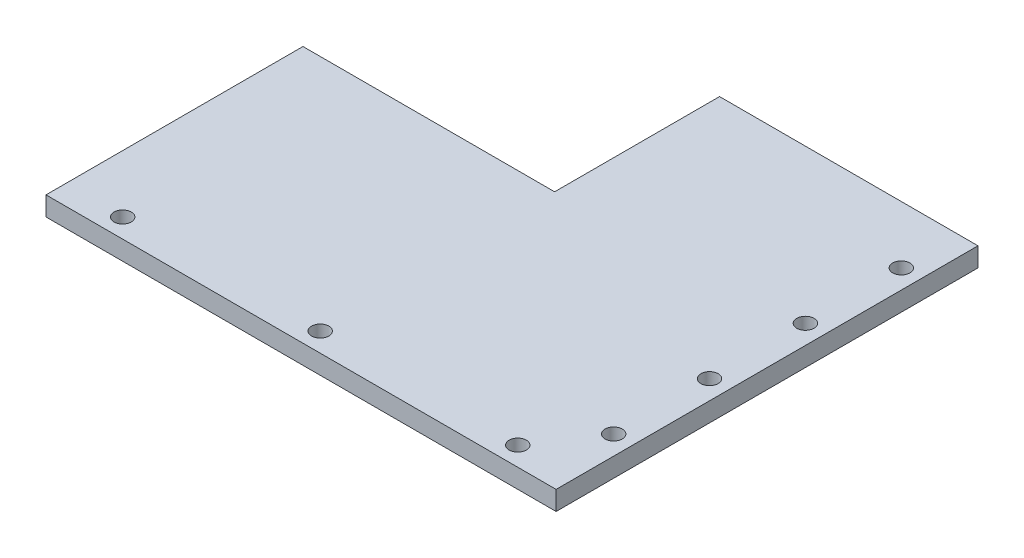
ISO-10303-21;
HEADER;
FILE_DESCRIPTION(('STEP AP214'),'2;1');
FILE_NAME('part.step','',(''),(''),'','','');
FILE_SCHEMA(('AUTOMOTIVE_DESIGN { 1 0 10303 214 1 1 1 1 }'));
ENDSEC;
DATA;
#1=APPLICATION_CONTEXT('core data for automotive mechanical design processes');
#2=APPLICATION_PROTOCOL_DEFINITION('international standard','automotive_design',2000,#1);
#3=PRODUCT_CONTEXT('',#1,'mechanical');
#4=PRODUCT('Part','Part','',(#3));
#5=PRODUCT_RELATED_PRODUCT_CATEGORY('part','',(#4));
#6=PRODUCT_DEFINITION_FORMATION('','',#4);
#7=PRODUCT_DEFINITION_CONTEXT('part definition',#1,'design');
#8=PRODUCT_DEFINITION('design','',#6,#7);
#9=PRODUCT_DEFINITION_SHAPE('','',#8);
#10=(LENGTH_UNIT() NAMED_UNIT(*) SI_UNIT(.MILLI.,.METRE.));
#11=(NAMED_UNIT(*) PLANE_ANGLE_UNIT() SI_UNIT($,.RADIAN.));
#12=(NAMED_UNIT(*) SI_UNIT($,.STERADIAN.) SOLID_ANGLE_UNIT());
#13=UNCERTAINTY_MEASURE_WITH_UNIT(LENGTH_MEASURE(1.E-05),#10,'distance_accuracy_value','');
#14=(GEOMETRIC_REPRESENTATION_CONTEXT(3) GLOBAL_UNCERTAINTY_ASSIGNED_CONTEXT((#13)) GLOBAL_UNIT_ASSIGNED_CONTEXT((#10,
#11,#12)) REPRESENTATION_CONTEXT('',''));
#15=CARTESIAN_POINT('',(0.,0.,0.));
#16=DIRECTION('',(0.,0.,1.));
#17=DIRECTION('',(1.,0.,0.));
#18=AXIS2_PLACEMENT_3D('',#15,#16,#17);
#19=CARTESIAN_POINT('',(0.,5.,0.));
#20=DIRECTION('',(0.,1.,0.));
#21=DIRECTION('',(0.,0.,1.));
#22=AXIS2_PLACEMENT_3D('',#19,#20,#21);
#23=PLANE('',#22);
#24=CARTESIAN_POINT('',(-50.6134210190672,5.,49.2667391887022));
#25=DIRECTION('',(0.,1.,0.));
#26=DIRECTION('',(0.,0.,1.));
#27=AXIS2_PLACEMENT_3D('',#24,#25,#26);
#28=CIRCLE('',#27,2.25);
#29=CARTESIAN_POINT('',(-50.6134210190672,5.,51.5167391887022));
#30=VERTEX_POINT('',#29);
#31=EDGE_CURVE('E224',#30,#30,#28,.T.);
#32=ORIENTED_EDGE('',*,*,#31,.F.);
#33=EDGE_LOOP('',(#32));
#34=FACE_BOUND('',#33,.T.);
#35=CARTESIAN_POINT('',(62.3865789809338,5.,34.2667391887022));
#36=DIRECTION('',(0.,1.,0.));
#37=DIRECTION('',(0.,0.,1.));
#38=AXIS2_PLACEMENT_3D('',#35,#36,#37);
#39=CIRCLE('',#38,2.25);
#40=CARTESIAN_POINT('',(62.3865789809338,5.,36.5167391887022));
#41=VERTEX_POINT('',#40);
#42=EDGE_CURVE('E240',#41,#41,#39,.T.);
#43=ORIENTED_EDGE('',*,*,#42,.F.);
#44=EDGE_LOOP('',(#43));
#45=FACE_BOUND('',#44,.T.);
#46=CARTESIAN_POINT('',(62.3865789809331,5.,-15.7332608112978));
#47=DIRECTION('',(0.,1.,0.));
#48=DIRECTION('',(0.,0.,1.));
#49=AXIS2_PLACEMENT_3D('',#46,#47,#48);
#50=CIRCLE('',#49,2.25);
#51=CARTESIAN_POINT('',(62.3865789809331,5.,-13.4832608112978));
#52=VERTEX_POINT('',#51);
#53=EDGE_CURVE('E256',#52,#52,#50,.T.);
#54=ORIENTED_EDGE('',*,*,#53,.F.);
#55=EDGE_LOOP('',(#54));
#56=FACE_BOUND('',#55,.T.);
#57=DIRECTION('',(0.,0.,-1.));
#58=VECTOR('',#57,1.);
#59=CARTESIAN_POINT('',(67.3865789809328,5.,-55.7332608112978));
#60=LINE('',#59,#58);
#61=CARTESIAN_POINT('',(67.3865789809328,5.,54.2667391887022));
#62=VERTEX_POINT('',#61);
#63=CARTESIAN_POINT('',(67.3865789809328,5.,-55.7332608112978));
#64=VERTEX_POINT('',#63);
#65=EDGE_CURVE('E146',#62,#64,#60,.T.);
#66=ORIENTED_EDGE('',*,*,#65,.T.);
#67=DIRECTION('',(-1.,0.,0.));
#68=VECTOR('',#67,1.);
#69=CARTESIAN_POINT('',(0.,5.,-55.7332608112978));
#70=LINE('',#69,#68);
#71=CARTESIAN_POINT('',(0.,5.,-55.7332608112978));
#72=VERTEX_POINT('',#71);
#73=EDGE_CURVE('E94',#64,#72,#70,.T.);
#74=ORIENTED_EDGE('',*,*,#73,.T.);
#75=DIRECTION('',(0.,0.,1.));
#76=VECTOR('',#75,1.);
#77=CARTESIAN_POINT('',(0.,5.,-55.7332608112978));
#78=LINE('',#77,#76);
#79=CARTESIAN_POINT('',(0.,5.,-12.7332608112978));
#80=VERTEX_POINT('',#79);
#81=EDGE_CURVE('E107',#72,#80,#78,.T.);
#82=ORIENTED_EDGE('',*,*,#81,.T.);
#83=DIRECTION('',(-1.,0.,0.));
#84=VECTOR('',#83,1.);
#85=CARTESIAN_POINT('',(0.,5.,-12.7332608112978));
#86=LINE('',#85,#84);
#87=CARTESIAN_POINT('',(-65.6134210190672,5.,-12.7332608112978));
#88=VERTEX_POINT('',#87);
#89=EDGE_CURVE('E101',#80,#88,#86,.T.);
#90=ORIENTED_EDGE('',*,*,#89,.T.);
#91=DIRECTION('',(0.,0.,1.));
#92=VECTOR('',#91,1.);
#93=CARTESIAN_POINT('',(-65.6134210190672,5.,-12.7332608112978));
#94=LINE('',#93,#92);
#95=CARTESIAN_POINT('',(-65.6134210190672,5.,54.2667391887022));
#96=VERTEX_POINT('',#95);
#97=EDGE_CURVE('E105',#88,#96,#94,.T.);
#98=ORIENTED_EDGE('',*,*,#97,.T.);
#99=DIRECTION('',(1.,0.,0.));
#100=VECTOR('',#99,1.);
#101=CARTESIAN_POINT('',(-65.6134210190672,5.,54.2667391887022));
#102=LINE('',#101,#100);
#103=EDGE_CURVE('E57',#96,#62,#102,.T.);
#104=ORIENTED_EDGE('',*,*,#103,.T.);
#105=EDGE_LOOP('',(#66,#74,#82,#90,#98,#104));
#106=FACE_BOUND('',#105,.T.);
#107=CARTESIAN_POINT('',(62.3865789809328,5.,-40.7332608112978));
#108=DIRECTION('',(0.,1.,0.));
#109=DIRECTION('',(0.,0.,1.));
#110=AXIS2_PLACEMENT_3D('',#107,#108,#109);
#111=CIRCLE('',#110,2.25);
#112=CARTESIAN_POINT('',(62.3865789809328,5.,-38.4832608112978));
#113=VERTEX_POINT('',#112);
#114=EDGE_CURVE('E134',#113,#113,#111,.T.);
#115=ORIENTED_EDGE('',*,*,#114,.F.);
#116=EDGE_LOOP('',(#115));
#117=FACE_BOUND('',#116,.T.);
#118=CARTESIAN_POINT('',(62.3865789809335,5.,9.26673918870222));
#119=DIRECTION('',(0.,1.,0.));
#120=DIRECTION('',(0.,0.,1.));
#121=AXIS2_PLACEMENT_3D('',#118,#119,#120);
#122=CIRCLE('',#121,2.25);
#123=CARTESIAN_POINT('',(62.3865789809335,5.,11.5167391887022));
#124=VERTEX_POINT('',#123);
#125=EDGE_CURVE('E248',#124,#124,#122,.T.);
#126=ORIENTED_EDGE('',*,*,#125,.F.);
#127=EDGE_LOOP('',(#126));
#128=FACE_BOUND('',#127,.T.);
#129=CARTESIAN_POINT('',(0.886578980932765,5.,49.2667391887022));
#130=DIRECTION('',(0.,1.,0.));
#131=DIRECTION('',(0.,0.,1.));
#132=AXIS2_PLACEMENT_3D('',#129,#130,#131);
#133=CIRCLE('',#132,2.25);
#134=CARTESIAN_POINT('',(0.886578980932765,5.,51.5167391887022));
#135=VERTEX_POINT('',#134);
#136=EDGE_CURVE('E232',#135,#135,#133,.T.);
#137=ORIENTED_EDGE('',*,*,#136,.F.);
#138=EDGE_LOOP('',(#137));
#139=FACE_BOUND('',#138,.T.);
#140=CARTESIAN_POINT('',(52.3865789809328,5.,49.2667391887022));
#141=DIRECTION('',(0.,1.,0.));
#142=DIRECTION('',(0.,0.,-1.));
#143=AXIS2_PLACEMENT_3D('',#140,#141,#142);
#144=CIRCLE('',#143,2.25);
#145=CARTESIAN_POINT('',(52.3865789809328,5.,47.0167391887022));
#146=VERTEX_POINT('',#145);
#147=EDGE_CURVE('E213',#146,#146,#144,.T.);
#148=ORIENTED_EDGE('',*,*,#147,.F.);
#149=EDGE_LOOP('',(#148));
#150=FACE_BOUND('',#149,.T.);
#151=ADVANCED_FACE('F39',(#34,#45,#56,#106,#117,#128,#139,#150),#23,.T.);
#152=CARTESIAN_POINT('',(0.,0.,0.));
#153=DIRECTION('',(0.,1.,0.));
#154=DIRECTION('',(0.,0.,1.));
#155=AXIS2_PLACEMENT_3D('',#152,#153,#154);
#156=PLANE('',#155);
#157=DIRECTION('',(0.,0.,-1.));
#158=VECTOR('',#157,1.);
#159=CARTESIAN_POINT('',(67.3865789809328,0.,-55.7332608112978));
#160=LINE('',#159,#158);
#161=CARTESIAN_POINT('',(67.3865789809328,0.,54.2667391887022));
#162=VERTEX_POINT('',#161);
#163=CARTESIAN_POINT('',(67.3865789809328,0.,-55.7332608112978));
#164=VERTEX_POINT('',#163);
#165=EDGE_CURVE('E129',#162,#164,#160,.T.);
#166=ORIENTED_EDGE('',*,*,#165,.F.);
#167=DIRECTION('',(1.,0.,0.));
#168=VECTOR('',#167,1.);
#169=CARTESIAN_POINT('',(-65.6134210190672,0.,54.2667391887022));
#170=LINE('',#169,#168);
#171=CARTESIAN_POINT('',(-65.6134210190672,0.,54.2667391887022));
#172=VERTEX_POINT('',#171);
#173=EDGE_CURVE('E86',#172,#162,#170,.T.);
#174=ORIENTED_EDGE('',*,*,#173,.F.);
#175=DIRECTION('',(0.,0.,1.));
#176=VECTOR('',#175,1.);
#177=CARTESIAN_POINT('',(-65.6134210190672,0.,-12.7332608112978));
#178=LINE('',#177,#176);
#179=CARTESIAN_POINT('',(-65.6134210190672,0.,-12.7332608112978));
#180=VERTEX_POINT('',#179);
#181=EDGE_CURVE('E80',#180,#172,#178,.T.);
#182=ORIENTED_EDGE('',*,*,#181,.F.);
#183=DIRECTION('',(-1.,0.,0.));
#184=VECTOR('',#183,1.);
#185=CARTESIAN_POINT('',(0.,0.,-12.7332608112978));
#186=LINE('',#185,#184);
#187=CARTESIAN_POINT('',(0.,0.,-12.7332608112978));
#188=VERTEX_POINT('',#187);
#189=EDGE_CURVE('E116',#188,#180,#186,.T.);
#190=ORIENTED_EDGE('',*,*,#189,.F.);
#191=DIRECTION('',(0.,0.,1.));
#192=VECTOR('',#191,1.);
#193=CARTESIAN_POINT('',(0.,0.,-55.7332608112978));
#194=LINE('',#193,#192);
#195=CARTESIAN_POINT('',(0.,0.,-55.7332608112978));
#196=VERTEX_POINT('',#195);
#197=EDGE_CURVE('E137',#196,#188,#194,.T.);
#198=ORIENTED_EDGE('',*,*,#197,.F.);
#199=DIRECTION('',(-1.,0.,0.));
#200=VECTOR('',#199,1.);
#201=CARTESIAN_POINT('',(0.,0.,-55.7332608112978));
#202=LINE('',#201,#200);
#203=EDGE_CURVE('E133',#164,#196,#202,.T.);
#204=ORIENTED_EDGE('',*,*,#203,.F.);
#205=EDGE_LOOP('',(#166,#174,#182,#190,#198,#204));
#206=FACE_BOUND('',#205,.T.);
#207=CARTESIAN_POINT('',(62.3865789809328,0.,-40.7332608112978));
#208=DIRECTION('',(0.,1.,0.));
#209=DIRECTION('',(0.,0.,1.));
#210=AXIS2_PLACEMENT_3D('',#207,#208,#209);
#211=CIRCLE('',#210,2.25);
#212=CARTESIAN_POINT('',(62.3865789809328,0.,-38.4832608112978));
#213=VERTEX_POINT('',#212);
#214=EDGE_CURVE('E260',#213,#213,#211,.T.);
#215=ORIENTED_EDGE('',*,*,#214,.T.);
#216=EDGE_LOOP('',(#215));
#217=FACE_BOUND('',#216,.T.);
#218=CARTESIAN_POINT('',(62.3865789809331,0.,-15.7332608112978));
#219=DIRECTION('',(0.,1.,0.));
#220=DIRECTION('',(0.,0.,1.));
#221=AXIS2_PLACEMENT_3D('',#218,#219,#220);
#222=CIRCLE('',#221,2.25);
#223=CARTESIAN_POINT('',(62.3865789809331,0.,-13.4832608112978));
#224=VERTEX_POINT('',#223);
#225=EDGE_CURVE('E252',#224,#224,#222,.T.);
#226=ORIENTED_EDGE('',*,*,#225,.T.);
#227=EDGE_LOOP('',(#226));
#228=FACE_BOUND('',#227,.T.);
#229=CARTESIAN_POINT('',(62.3865789809335,0.,9.26673918870222));
#230=DIRECTION('',(0.,1.,0.));
#231=DIRECTION('',(0.,0.,1.));
#232=AXIS2_PLACEMENT_3D('',#229,#230,#231);
#233=CIRCLE('',#232,2.25);
#234=CARTESIAN_POINT('',(62.3865789809335,0.,11.5167391887022));
#235=VERTEX_POINT('',#234);
#236=EDGE_CURVE('E244',#235,#235,#233,.T.);
#237=ORIENTED_EDGE('',*,*,#236,.T.);
#238=EDGE_LOOP('',(#237));
#239=FACE_BOUND('',#238,.T.);
#240=CARTESIAN_POINT('',(62.3865789809338,0.,34.2667391887022));
#241=DIRECTION('',(0.,1.,0.));
#242=DIRECTION('',(0.,0.,1.));
#243=AXIS2_PLACEMENT_3D('',#240,#241,#242);
#244=CIRCLE('',#243,2.25);
#245=CARTESIAN_POINT('',(62.3865789809338,0.,36.5167391887022));
#246=VERTEX_POINT('',#245);
#247=EDGE_CURVE('E236',#246,#246,#244,.T.);
#248=ORIENTED_EDGE('',*,*,#247,.T.);
#249=EDGE_LOOP('',(#248));
#250=FACE_BOUND('',#249,.T.);
#251=CARTESIAN_POINT('',(0.886578980932765,0.,49.2667391887022));
#252=DIRECTION('',(0.,1.,0.));
#253=DIRECTION('',(0.,0.,1.));
#254=AXIS2_PLACEMENT_3D('',#251,#252,#253);
#255=CIRCLE('',#254,2.25);
#256=CARTESIAN_POINT('',(0.886578980932765,0.,51.5167391887022));
#257=VERTEX_POINT('',#256);
#258=EDGE_CURVE('E228',#257,#257,#255,.T.);
#259=ORIENTED_EDGE('',*,*,#258,.T.);
#260=EDGE_LOOP('',(#259));
#261=FACE_BOUND('',#260,.T.);
#262=CARTESIAN_POINT('',(-50.6134210190672,0.,49.2667391887022));
#263=DIRECTION('',(0.,1.,0.));
#264=DIRECTION('',(0.,0.,1.));
#265=AXIS2_PLACEMENT_3D('',#262,#263,#264);
#266=CIRCLE('',#265,2.25);
#267=CARTESIAN_POINT('',(-50.6134210190672,0.,51.5167391887022));
#268=VERTEX_POINT('',#267);
#269=EDGE_CURVE('E221',#268,#268,#266,.T.);
#270=ORIENTED_EDGE('',*,*,#269,.T.);
#271=EDGE_LOOP('',(#270));
#272=FACE_BOUND('',#271,.T.);
#273=CARTESIAN_POINT('',(52.3865789809328,0.,49.2667391887022));
#274=DIRECTION('',(0.,1.,0.));
#275=DIRECTION('',(0.,0.,-1.));
#276=AXIS2_PLACEMENT_3D('',#273,#274,#275);
#277=CIRCLE('',#276,2.25);
#278=CARTESIAN_POINT('',(52.3865789809328,0.,47.0167391887022));
#279=VERTEX_POINT('',#278);
#280=EDGE_CURVE('E216',#279,#279,#277,.T.);
#281=ORIENTED_EDGE('',*,*,#280,.T.);
#282=EDGE_LOOP('',(#281));
#283=FACE_BOUND('',#282,.T.);
#284=ADVANCED_FACE('F159',(#206,#217,#228,#239,#250,#261,#272,#283),#156,.F.);
#285=CARTESIAN_POINT('',(67.3865789809328,5.,-55.7332608112978));
#286=DIRECTION('',(-1.,0.,0.));
#287=DIRECTION('',(0.,0.,1.));
#288=AXIS2_PLACEMENT_3D('',#285,#286,#287);
#289=PLANE('',#288);
#290=ORIENTED_EDGE('',*,*,#165,.T.);
#291=DIRECTION('',(0.,-1.,0.));
#292=VECTOR('',#291,1.);
#293=CARTESIAN_POINT('',(67.3865789809328,5.,-55.7332608112978));
#294=LINE('',#293,#292);
#295=EDGE_CURVE('E11',#64,#164,#294,.T.);
#296=ORIENTED_EDGE('',*,*,#295,.F.);
#297=ORIENTED_EDGE('',*,*,#65,.F.);
#298=DIRECTION('',(0.,-1.,0.));
#299=VECTOR('',#298,1.);
#300=CARTESIAN_POINT('',(67.3865789809328,5.,54.2667391887022));
#301=LINE('',#300,#299);
#302=EDGE_CURVE('E125',#62,#162,#301,.T.);
#303=ORIENTED_EDGE('',*,*,#302,.T.);
#304=EDGE_LOOP('',(#290,#296,#297,#303));
#305=FACE_BOUND('',#304,.T.);
#306=ADVANCED_FACE('F41',(#305),#289,.F.);
#307=CARTESIAN_POINT('',(0.,5.,-55.7332608112978));
#308=DIRECTION('',(0.,0.,1.));
#309=DIRECTION('',(1.,0.,0.));
#310=AXIS2_PLACEMENT_3D('',#307,#308,#309);
#311=PLANE('',#310);
#312=ORIENTED_EDGE('',*,*,#203,.T.);
#313=DIRECTION('',(0.,-1.,0.));
#314=VECTOR('',#313,1.);
#315=CARTESIAN_POINT('',(0.,5.,-55.7332608112978));
#316=LINE('',#315,#314);
#317=EDGE_CURVE('E49',#72,#196,#316,.T.);
#318=ORIENTED_EDGE('',*,*,#317,.F.);
#319=ORIENTED_EDGE('',*,*,#73,.F.);
#320=ORIENTED_EDGE('',*,*,#295,.T.);
#321=EDGE_LOOP('',(#312,#318,#319,#320));
#322=FACE_BOUND('',#321,.T.);
#323=ADVANCED_FACE('F351',(#322),#311,.F.);
#324=CARTESIAN_POINT('',(0.,5.,-55.7332608112978));
#325=DIRECTION('',(1.,0.,0.));
#326=DIRECTION('',(0.,0.,-1.));
#327=AXIS2_PLACEMENT_3D('',#324,#325,#326);
#328=PLANE('',#327);
#329=ORIENTED_EDGE('',*,*,#197,.T.);
#330=DIRECTION('',(0.,-1.,0.));
#331=VECTOR('',#330,1.);
#332=CARTESIAN_POINT('',(0.,5.,-12.7332608112978));
#333=LINE('',#332,#331);
#334=EDGE_CURVE('E118',#80,#188,#333,.T.);
#335=ORIENTED_EDGE('',*,*,#334,.F.);
#336=ORIENTED_EDGE('',*,*,#81,.F.);
#337=ORIENTED_EDGE('',*,*,#317,.T.);
#338=EDGE_LOOP('',(#329,#335,#336,#337));
#339=FACE_BOUND('',#338,.T.);
#340=ADVANCED_FACE('F156',(#339),#328,.F.);
#341=CARTESIAN_POINT('',(0.,5.,-12.7332608112978));
#342=DIRECTION('',(0.,0.,1.));
#343=DIRECTION('',(1.,0.,0.));
#344=AXIS2_PLACEMENT_3D('',#341,#342,#343);
#345=PLANE('',#344);
#346=ORIENTED_EDGE('',*,*,#189,.T.);
#347=DIRECTION('',(0.,-1.,0.));
#348=VECTOR('',#347,1.);
#349=CARTESIAN_POINT('',(-65.6134210190672,5.,-12.7332608112978));
#350=LINE('',#349,#348);
#351=EDGE_CURVE('E113',#88,#180,#350,.T.);
#352=ORIENTED_EDGE('',*,*,#351,.F.);
#353=ORIENTED_EDGE('',*,*,#89,.F.);
#354=ORIENTED_EDGE('',*,*,#334,.T.);
#355=EDGE_LOOP('',(#346,#352,#353,#354));
#356=FACE_BOUND('',#355,.T.);
#357=ADVANCED_FACE('F114',(#356),#345,.F.);
#358=CARTESIAN_POINT('',(-65.6134210190672,5.,-12.7332608112978));
#359=DIRECTION('',(1.,0.,0.));
#360=DIRECTION('',(0.,0.,-1.));
#361=AXIS2_PLACEMENT_3D('',#358,#359,#360);
#362=PLANE('',#361);
#363=ORIENTED_EDGE('',*,*,#181,.T.);
#364=DIRECTION('',(0.,-1.,0.));
#365=VECTOR('',#364,1.);
#366=CARTESIAN_POINT('',(-65.6134210190672,5.,54.2667391887022));
#367=LINE('',#366,#365);
#368=EDGE_CURVE('E119',#96,#172,#367,.T.);
#369=ORIENTED_EDGE('',*,*,#368,.F.);
#370=ORIENTED_EDGE('',*,*,#97,.F.);
#371=ORIENTED_EDGE('',*,*,#351,.T.);
#372=EDGE_LOOP('',(#363,#369,#370,#371));
#373=FACE_BOUND('',#372,.T.);
#374=ADVANCED_FACE('F121',(#373),#362,.F.);
#375=CARTESIAN_POINT('',(-65.6134210190672,5.,54.2667391887022));
#376=DIRECTION('',(0.,0.,-1.));
#377=DIRECTION('',(-1.,0.,0.));
#378=AXIS2_PLACEMENT_3D('',#375,#376,#377);
#379=PLANE('',#378);
#380=ORIENTED_EDGE('',*,*,#173,.T.);
#381=ORIENTED_EDGE('',*,*,#302,.F.);
#382=ORIENTED_EDGE('',*,*,#103,.F.);
#383=ORIENTED_EDGE('',*,*,#368,.T.);
#384=EDGE_LOOP('',(#380,#381,#382,#383));
#385=FACE_BOUND('',#384,.T.);
#386=ADVANCED_FACE('F164',(#385),#379,.F.);
#387=CARTESIAN_POINT('',(62.3865789809328,5.,-40.7332608112978));
#388=DIRECTION('',(0.,-1.,0.));
#389=DIRECTION('',(0.,0.,-1.));
#390=AXIS2_PLACEMENT_3D('',#387,#388,#389);
#391=CYLINDRICAL_SURFACE('',#390,2.25);
#392=ORIENTED_EDGE('',*,*,#114,.T.);
#393=EDGE_LOOP('',(#392));
#394=FACE_BOUND('',#393,.T.);
#395=ORIENTED_EDGE('',*,*,#214,.F.);
#396=EDGE_LOOP('',(#395));
#397=FACE_BOUND('',#396,.T.);
#398=ADVANCED_FACE('F166',(#394,#397),#391,.F.);
#399=CARTESIAN_POINT('',(62.3865789809331,5.,-15.7332608112978));
#400=DIRECTION('',(0.,-1.,0.));
#401=DIRECTION('',(0.,0.,-1.));
#402=AXIS2_PLACEMENT_3D('',#399,#400,#401);
#403=CYLINDRICAL_SURFACE('',#402,2.25);
#404=ORIENTED_EDGE('',*,*,#53,.T.);
#405=EDGE_LOOP('',(#404));
#406=FACE_BOUND('',#405,.T.);
#407=ORIENTED_EDGE('',*,*,#225,.F.);
#408=EDGE_LOOP('',(#407));
#409=FACE_BOUND('',#408,.T.);
#410=ADVANCED_FACE('F172',(#406,#409),#403,.F.);
#411=CARTESIAN_POINT('',(62.3865789809335,5.,9.26673918870222));
#412=DIRECTION('',(0.,-1.,0.));
#413=DIRECTION('',(0.,0.,-1.));
#414=AXIS2_PLACEMENT_3D('',#411,#412,#413);
#415=CYLINDRICAL_SURFACE('',#414,2.25);
#416=ORIENTED_EDGE('',*,*,#125,.T.);
#417=EDGE_LOOP('',(#416));
#418=FACE_BOUND('',#417,.T.);
#419=ORIENTED_EDGE('',*,*,#236,.F.);
#420=EDGE_LOOP('',(#419));
#421=FACE_BOUND('',#420,.T.);
#422=ADVANCED_FACE('F188',(#418,#421),#415,.F.);
#423=CARTESIAN_POINT('',(62.3865789809338,5.,34.2667391887022));
#424=DIRECTION('',(0.,-1.,0.));
#425=DIRECTION('',(0.,0.,-1.));
#426=AXIS2_PLACEMENT_3D('',#423,#424,#425);
#427=CYLINDRICAL_SURFACE('',#426,2.25);
#428=ORIENTED_EDGE('',*,*,#42,.T.);
#429=EDGE_LOOP('',(#428));
#430=FACE_BOUND('',#429,.T.);
#431=ORIENTED_EDGE('',*,*,#247,.F.);
#432=EDGE_LOOP('',(#431));
#433=FACE_BOUND('',#432,.T.);
#434=ADVANCED_FACE('F192',(#430,#433),#427,.F.);
#435=CARTESIAN_POINT('',(0.886578980932765,5.,49.2667391887022));
#436=DIRECTION('',(0.,-1.,0.));
#437=DIRECTION('',(0.,0.,-1.));
#438=AXIS2_PLACEMENT_3D('',#435,#436,#437);
#439=CYLINDRICAL_SURFACE('',#438,2.25);
#440=ORIENTED_EDGE('',*,*,#136,.T.);
#441=EDGE_LOOP('',(#440));
#442=FACE_BOUND('',#441,.T.);
#443=ORIENTED_EDGE('',*,*,#258,.F.);
#444=EDGE_LOOP('',(#443));
#445=FACE_BOUND('',#444,.T.);
#446=ADVANCED_FACE('F196',(#442,#445),#439,.F.);
#447=CARTESIAN_POINT('',(-50.6134210190672,5.,49.2667391887022));
#448=DIRECTION('',(0.,-1.,0.));
#449=DIRECTION('',(0.,0.,-1.));
#450=AXIS2_PLACEMENT_3D('',#447,#448,#449);
#451=CYLINDRICAL_SURFACE('',#450,2.25);
#452=ORIENTED_EDGE('',*,*,#31,.T.);
#453=EDGE_LOOP('',(#452));
#454=FACE_BOUND('',#453,.T.);
#455=ORIENTED_EDGE('',*,*,#269,.F.);
#456=EDGE_LOOP('',(#455));
#457=FACE_BOUND('',#456,.T.);
#458=ADVANCED_FACE('F200',(#454,#457),#451,.F.);
#459=CARTESIAN_POINT('',(52.3865789809328,5.,49.2667391887022));
#460=DIRECTION('',(0.,-1.,0.));
#461=DIRECTION('',(0.,0.,-1.));
#462=AXIS2_PLACEMENT_3D('',#459,#460,#461);
#463=CYLINDRICAL_SURFACE('',#462,2.25);
#464=ORIENTED_EDGE('',*,*,#147,.T.);
#465=EDGE_LOOP('',(#464));
#466=FACE_BOUND('',#465,.T.);
#467=ORIENTED_EDGE('',*,*,#280,.F.);
#468=EDGE_LOOP('',(#467));
#469=FACE_BOUND('',#468,.T.);
#470=ADVANCED_FACE('F204',(#466,#469),#463,.F.);
#471=CLOSED_SHELL('',(#151,#284,#306,#323,#340,#357,#374,#386,#398,#410,#422,#434,#446,#458,#470));
#472=MANIFOLD_SOLID_BREP('B2',#471);
#473=ADVANCED_BREP_SHAPE_REPRESENTATION('',(#18,#472),#14);
#474=SHAPE_DEFINITION_REPRESENTATION(#9,#473);
ENDSEC;
END-ISO-10303-21;
